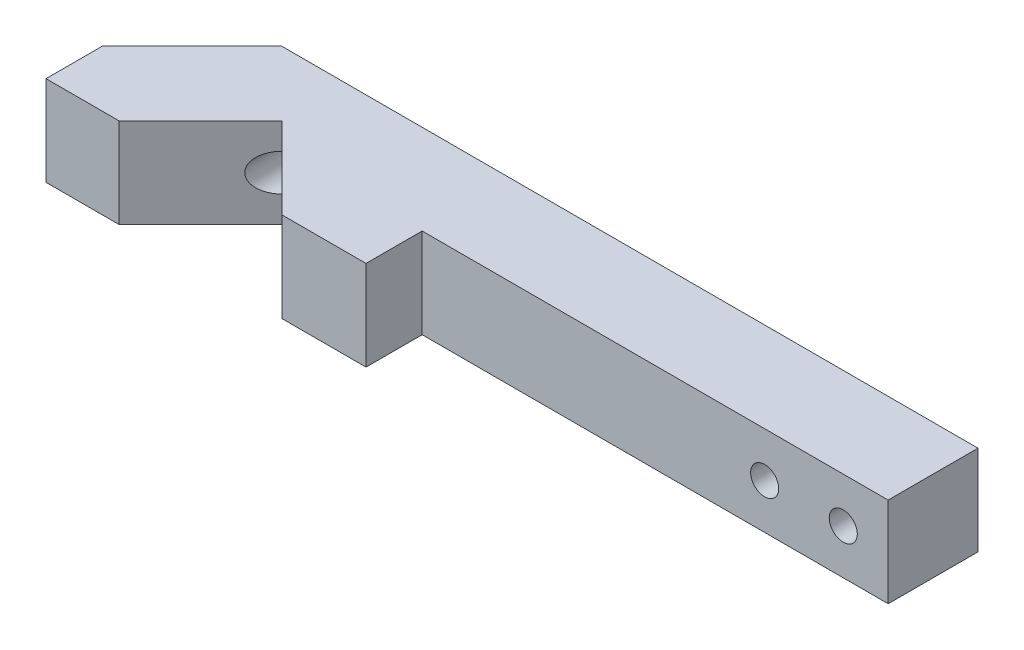
ISO-10303-21;
HEADER;
FILE_DESCRIPTION(('STEP AP214'),'2;1');
FILE_NAME('part.step','',(''),(''),'','','');
FILE_SCHEMA(('AUTOMOTIVE_DESIGN { 1 0 10303 214 1 1 1 1 }'));
ENDSEC;
DATA;
#1=APPLICATION_CONTEXT('core data for automotive mechanical design processes');
#2=APPLICATION_PROTOCOL_DEFINITION('international standard','automotive_design',2000,#1);
#3=PRODUCT_CONTEXT('',#1,'mechanical');
#4=PRODUCT('Part','Part','',(#3));
#5=PRODUCT_RELATED_PRODUCT_CATEGORY('part','',(#4));
#6=PRODUCT_DEFINITION_FORMATION('','',#4);
#7=PRODUCT_DEFINITION_CONTEXT('part definition',#1,'design');
#8=PRODUCT_DEFINITION('design','',#6,#7);
#9=PRODUCT_DEFINITION_SHAPE('','',#8);
#10=(LENGTH_UNIT() NAMED_UNIT(*) SI_UNIT(.MILLI.,.METRE.));
#11=(NAMED_UNIT(*) PLANE_ANGLE_UNIT() SI_UNIT($,.RADIAN.));
#12=(NAMED_UNIT(*) SI_UNIT($,.STERADIAN.) SOLID_ANGLE_UNIT());
#13=UNCERTAINTY_MEASURE_WITH_UNIT(LENGTH_MEASURE(1.E-05),#10,'distance_accuracy_value','');
#14=(GEOMETRIC_REPRESENTATION_CONTEXT(3) GLOBAL_UNCERTAINTY_ASSIGNED_CONTEXT((#13)) GLOBAL_UNIT_ASSIGNED_CONTEXT((#10,
#11,#12)) REPRESENTATION_CONTEXT('',''));
#15=CARTESIAN_POINT('',(0.,0.,0.));
#16=DIRECTION('',(0.,0.,1.));
#17=DIRECTION('',(1.,0.,0.));
#18=AXIS2_PLACEMENT_3D('',#15,#16,#17);
#19=CARTESIAN_POINT('',(-6.50000000000001,8.,4.));
#20=DIRECTION('',(0.,0.,-1.));
#21=DIRECTION('',(-1.,0.,0.));
#22=AXIS2_PLACEMENT_3D('',#19,#20,#21);
#23=PLANE('',#22);
#24=CARTESIAN_POINT('',(31.,4.,4.));
#25=DIRECTION('',(0.,0.,-1.));
#26=DIRECTION('',(-1.,0.,0.));
#27=AXIS2_PLACEMENT_3D('',#24,#25,#26);
#28=CIRCLE('',#27,1.25);
#29=CARTESIAN_POINT('',(29.75,4.,4.));
#30=VERTEX_POINT('',#29);
#31=EDGE_CURVE('E48',#30,#30,#28,.T.);
#32=ORIENTED_EDGE('',*,*,#31,.T.);
#33=EDGE_LOOP('',(#32));
#34=FACE_BOUND('',#33,.T.);
#35=CARTESIAN_POINT('',(24.,4.,4.));
#36=DIRECTION('',(0.,0.,-1.));
#37=DIRECTION('',(-1.,0.,0.));
#38=AXIS2_PLACEMENT_3D('',#35,#36,#37);
#39=CIRCLE('',#38,1.25);
#40=CARTESIAN_POINT('',(22.75,4.,4.));
#41=VERTEX_POINT('',#40);
#42=EDGE_CURVE('E282',#41,#41,#39,.T.);
#43=ORIENTED_EDGE('',*,*,#42,.T.);
#44=EDGE_LOOP('',(#43));
#45=FACE_BOUND('',#44,.T.);
#46=DIRECTION('',(1.,0.,0.));
#47=VECTOR('',#46,1.);
#48=CARTESIAN_POINT('',(-6.50000000000001,0.,4.));
#49=LINE('',#48,#47);
#50=CARTESIAN_POINT('',(-6.50000000000001,0.,4.));
#51=VERTEX_POINT('',#50);
#52=CARTESIAN_POINT('',(35.,0.,4.));
#53=VERTEX_POINT('',#52);
#54=EDGE_CURVE('E168',#51,#53,#49,.T.);
#55=ORIENTED_EDGE('',*,*,#54,.T.);
#56=DIRECTION('',(0.,-1.,0.));
#57=VECTOR('',#56,1.);
#58=CARTESIAN_POINT('',(35.,8.,4.));
#59=LINE('',#58,#57);
#60=CARTESIAN_POINT('',(35.,8.,4.));
#61=VERTEX_POINT('',#60);
#62=EDGE_CURVE('E54',#61,#53,#59,.T.);
#63=ORIENTED_EDGE('',*,*,#62,.F.);
#64=DIRECTION('',(1.,0.,0.));
#65=VECTOR('',#64,1.);
#66=CARTESIAN_POINT('',(-6.50000000000001,8.,4.));
#67=LINE('',#66,#65);
#68=CARTESIAN_POINT('',(-6.50000000000001,8.,4.));
#69=VERTEX_POINT('',#68);
#70=EDGE_CURVE('E198',#69,#61,#67,.T.);
#71=ORIENTED_EDGE('',*,*,#70,.F.);
#72=DIRECTION('',(0.,-1.,0.));
#73=VECTOR('',#72,1.);
#74=CARTESIAN_POINT('',(-6.50000000000001,8.,4.));
#75=LINE('',#74,#73);
#76=EDGE_CURVE('E164',#69,#51,#75,.T.);
#77=ORIENTED_EDGE('',*,*,#76,.T.);
#78=EDGE_LOOP('',(#55,#63,#71,#77));
#79=FACE_BOUND('',#78,.T.);
#80=ADVANCED_FACE('F45',(#34,#45,#79),#23,.F.);
#81=CARTESIAN_POINT('',(35.,8.,-4.));
#82=DIRECTION('',(-1.,0.,0.));
#83=DIRECTION('',(0.,0.,1.));
#84=AXIS2_PLACEMENT_3D('',#81,#82,#83);
#85=PLANE('',#84);
#86=DIRECTION('',(0.,0.,-1.));
#87=VECTOR('',#86,1.);
#88=CARTESIAN_POINT('',(35.,0.,-4.));
#89=LINE('',#88,#87);
#90=CARTESIAN_POINT('',(35.,0.,-4.));
#91=VERTEX_POINT('',#90);
#92=EDGE_CURVE('E172',#53,#91,#89,.T.);
#93=ORIENTED_EDGE('',*,*,#92,.T.);
#94=DIRECTION('',(0.,-1.,0.));
#95=VECTOR('',#94,1.);
#96=CARTESIAN_POINT('',(35.,8.,-4.));
#97=LINE('',#96,#95);
#98=CARTESIAN_POINT('',(35.,8.,-4.));
#99=VERTEX_POINT('',#98);
#100=EDGE_CURVE('E222',#99,#91,#97,.T.);
#101=ORIENTED_EDGE('',*,*,#100,.F.);
#102=DIRECTION('',(0.,0.,-1.));
#103=VECTOR('',#102,1.);
#104=CARTESIAN_POINT('',(35.,8.,-4.));
#105=LINE('',#104,#103);
#106=EDGE_CURVE('E116',#61,#99,#105,.T.);
#107=ORIENTED_EDGE('',*,*,#106,.F.);
#108=ORIENTED_EDGE('',*,*,#62,.T.);
#109=EDGE_LOOP('',(#93,#101,#107,#108));
#110=FACE_BOUND('',#109,.T.);
#111=ADVANCED_FACE('F228',(#110),#85,.F.);
#112=CARTESIAN_POINT('',(-27.0000000000001,8.,-4.));
#113=DIRECTION('',(0.,0.,1.));
#114=DIRECTION('',(1.,0.,0.));
#115=AXIS2_PLACEMENT_3D('',#112,#113,#114);
#116=PLANE('',#115);
#117=CARTESIAN_POINT('',(31.,4.,-4.));
#118=DIRECTION('',(0.,0.,-1.));
#119=DIRECTION('',(-1.,0.,0.));
#120=AXIS2_PLACEMENT_3D('',#117,#118,#119);
#121=CIRCLE('',#120,1.25);
#122=CARTESIAN_POINT('',(29.75,4.,-4.));
#123=VERTEX_POINT('',#122);
#124=EDGE_CURVE('E290',#123,#123,#121,.T.);
#125=ORIENTED_EDGE('',*,*,#124,.F.);
#126=EDGE_LOOP('',(#125));
#127=FACE_BOUND('',#126,.T.);
#128=CARTESIAN_POINT('',(24.,4.,-4.));
#129=DIRECTION('',(0.,0.,-1.));
#130=DIRECTION('',(-1.,0.,0.));
#131=AXIS2_PLACEMENT_3D('',#128,#129,#130);
#132=CIRCLE('',#131,1.25);
#133=CARTESIAN_POINT('',(22.75,4.,-4.));
#134=VERTEX_POINT('',#133);
#135=EDGE_CURVE('E286',#134,#134,#132,.T.);
#136=ORIENTED_EDGE('',*,*,#135,.F.);
#137=EDGE_LOOP('',(#136));
#138=FACE_BOUND('',#137,.T.);
#139=CARTESIAN_POINT('',(-21.25,4.,-4.));
#140=DIRECTION('',(0.,0.,-1.));
#141=DIRECTION('',(-1.,0.,0.));
#142=AXIS2_PLACEMENT_3D('',#139,#140,#141);
#143=CIRCLE('',#142,1.65);
#144=CARTESIAN_POINT('',(-22.9,4.,-4.));
#145=VERTEX_POINT('',#144);
#146=EDGE_CURVE('E271',#145,#145,#143,.T.);
#147=ORIENTED_EDGE('',*,*,#146,.F.);
#148=EDGE_LOOP('',(#147));
#149=FACE_BOUND('',#148,.T.);
#150=DIRECTION('',(-1.,0.,0.));
#151=VECTOR('',#150,1.);
#152=CARTESIAN_POINT('',(-27.0000000000001,0.,-4.));
#153=LINE('',#152,#151);
#154=CARTESIAN_POINT('',(-27.0000000000001,0.,-4.));
#155=VERTEX_POINT('',#154);
#156=EDGE_CURVE('E175',#91,#155,#153,.T.);
#157=ORIENTED_EDGE('',*,*,#156,.T.);
#158=DIRECTION('',(0.,-1.,0.));
#159=VECTOR('',#158,1.);
#160=CARTESIAN_POINT('',(-27.0000000000001,8.,-4.));
#161=LINE('',#160,#159);
#162=CARTESIAN_POINT('',(-27.0000000000001,8.,-4.));
#163=VERTEX_POINT('',#162);
#164=EDGE_CURVE('E218',#163,#155,#161,.T.);
#165=ORIENTED_EDGE('',*,*,#164,.F.);
#166=DIRECTION('',(-1.,0.,0.));
#167=VECTOR('',#166,1.);
#168=CARTESIAN_POINT('',(-27.0000000000001,8.,-4.));
#169=LINE('',#168,#167);
#170=EDGE_CURVE('E249',#99,#163,#169,.T.);
#171=ORIENTED_EDGE('',*,*,#170,.F.);
#172=ORIENTED_EDGE('',*,*,#100,.T.);
#173=EDGE_LOOP('',(#157,#165,#171,#172));
#174=FACE_BOUND('',#173,.T.);
#175=ADVANCED_FACE('F239',(#127,#138,#149,#174),#116,.F.);
#176=CARTESIAN_POINT('',(-35.,8.,4.));
#177=DIRECTION('',(0.707106781186553,0.,0.707106781186542));
#178=DIRECTION('',(0.707106781186542,0.,-0.707106781186553));
#179=AXIS2_PLACEMENT_3D('',#176,#177,#178);
#180=PLANE('',#179);
#181=DIRECTION('',(-0.707106781186542,0.,0.707106781186553));
#182=VECTOR('',#181,1.);
#183=CARTESIAN_POINT('',(-35.,0.,4.));
#184=LINE('',#183,#182);
#185=CARTESIAN_POINT('',(-35.,0.,4.));
#186=VERTEX_POINT('',#185);
#187=EDGE_CURVE('E178',#155,#186,#184,.T.);
#188=ORIENTED_EDGE('',*,*,#187,.T.);
#189=DIRECTION('',(0.,-1.,0.));
#190=VECTOR('',#189,1.);
#191=CARTESIAN_POINT('',(-35.,8.,4.));
#192=LINE('',#191,#190);
#193=CARTESIAN_POINT('',(-35.,8.,4.));
#194=VERTEX_POINT('',#193);
#195=EDGE_CURVE('E214',#194,#186,#192,.T.);
#196=ORIENTED_EDGE('',*,*,#195,.F.);
#197=DIRECTION('',(-0.707106781186542,0.,0.707106781186553));
#198=VECTOR('',#197,1.);
#199=CARTESIAN_POINT('',(-35.,8.,4.));
#200=LINE('',#199,#198);
#201=EDGE_CURVE('E245',#163,#194,#200,.T.);
#202=ORIENTED_EDGE('',*,*,#201,.F.);
#203=ORIENTED_EDGE('',*,*,#164,.T.);
#204=EDGE_LOOP('',(#188,#196,#202,#203));
#205=FACE_BOUND('',#204,.T.);
#206=ADVANCED_FACE('F243',(#205),#180,.F.);
#207=CARTESIAN_POINT('',(-35.,8.,4.));
#208=DIRECTION('',(1.,0.,0.));
#209=DIRECTION('',(0.,0.,-1.));
#210=AXIS2_PLACEMENT_3D('',#207,#208,#209);
#211=PLANE('',#210);
#212=DIRECTION('',(0.,0.,1.));
#213=VECTOR('',#212,1.);
#214=CARTESIAN_POINT('',(-35.,0.,4.));
#215=LINE('',#214,#213);
#216=CARTESIAN_POINT('',(-35.,0.,9.));
#217=VERTEX_POINT('',#216);
#218=EDGE_CURVE('E181',#186,#217,#215,.T.);
#219=ORIENTED_EDGE('',*,*,#218,.T.);
#220=DIRECTION('',(0.,-1.,0.));
#221=VECTOR('',#220,1.);
#222=CARTESIAN_POINT('',(-35.,8.,9.));
#223=LINE('',#222,#221);
#224=CARTESIAN_POINT('',(-35.,8.,9.));
#225=VERTEX_POINT('',#224);
#226=EDGE_CURVE('E210',#225,#217,#223,.T.);
#227=ORIENTED_EDGE('',*,*,#226,.F.);
#228=DIRECTION('',(0.,0.,1.));
#229=VECTOR('',#228,1.);
#230=CARTESIAN_POINT('',(-35.,8.,4.));
#231=LINE('',#230,#229);
#232=EDGE_CURVE('E248',#194,#225,#231,.T.);
#233=ORIENTED_EDGE('',*,*,#232,.F.);
#234=ORIENTED_EDGE('',*,*,#195,.T.);
#235=EDGE_LOOP('',(#219,#227,#233,#234));
#236=FACE_BOUND('',#235,.T.);
#237=ADVANCED_FACE('F323',(#236),#211,.F.);
#238=CARTESIAN_POINT('',(-35.,8.,9.));
#239=DIRECTION('',(0.,0.,-1.));
#240=DIRECTION('',(-1.,0.,0.));
#241=AXIS2_PLACEMENT_3D('',#238,#239,#240);
#242=PLANE('',#241);
#243=DIRECTION('',(1.,0.,0.));
#244=VECTOR('',#243,1.);
#245=CARTESIAN_POINT('',(-35.,0.,9.));
#246=LINE('',#245,#244);
#247=CARTESIAN_POINT('',(-28.5,0.,9.));
#248=VERTEX_POINT('',#247);
#249=EDGE_CURVE('E184',#217,#248,#246,.T.);
#250=ORIENTED_EDGE('',*,*,#249,.T.);
#251=DIRECTION('',(0.,-1.,0.));
#252=VECTOR('',#251,1.);
#253=CARTESIAN_POINT('',(-28.5,8.,9.));
#254=LINE('',#253,#252);
#255=CARTESIAN_POINT('',(-28.5,8.,9.));
#256=VERTEX_POINT('',#255);
#257=EDGE_CURVE('E206',#256,#248,#254,.T.);
#258=ORIENTED_EDGE('',*,*,#257,.F.);
#259=DIRECTION('',(1.,0.,0.));
#260=VECTOR('',#259,1.);
#261=CARTESIAN_POINT('',(-35.,8.,9.));
#262=LINE('',#261,#260);
#263=EDGE_CURVE('E253',#225,#256,#262,.T.);
#264=ORIENTED_EDGE('',*,*,#263,.F.);
#265=ORIENTED_EDGE('',*,*,#226,.T.);
#266=EDGE_LOOP('',(#250,#258,#264,#265));
#267=FACE_BOUND('',#266,.T.);
#268=ADVANCED_FACE('F264',(#267),#242,.F.);
#269=CARTESIAN_POINT('',(-28.5,8.,9.));
#270=DIRECTION('',(-0.707106781186551,0.,-0.707106781186544));
#271=DIRECTION('',(-0.707106781186544,0.,0.707106781186551));
#272=AXIS2_PLACEMENT_3D('',#269,#270,#271);
#273=PLANE('',#272);
#274=DIRECTION('',(0.,-1.,0.));
#275=VECTOR('',#274,1.);
#276=CARTESIAN_POINT('',(-21.25,8.,1.74999999999993));
#277=LINE('',#276,#275);
#278=CARTESIAN_POINT('',(-21.25,2.35,1.74999999999993));
#279=VERTEX_POINT('',#278);
#280=CARTESIAN_POINT('',(-21.25,0.,1.74999999999993));
#281=VERTEX_POINT('',#280);
#282=EDGE_CURVE('E157',#279,#281,#277,.T.);
#283=ORIENTED_EDGE('',*,*,#282,.F.);
#284=CARTESIAN_POINT('',(-21.25,4.,1.74999999999992));
#285=DIRECTION('',(-0.707106781186551,0.,-0.707106781186544));
#286=DIRECTION('',(0.707106781186544,0.,-0.707106781186551));
#287=AXIS2_PLACEMENT_3D('',#284,#285,#286);
#288=ELLIPSE('',#287,2.33345237791561,1.65);
#289=CARTESIAN_POINT('',(-21.25,5.65,1.74999999999993));
#290=VERTEX_POINT('',#289);
#291=EDGE_CURVE('E11',#279,#290,#288,.T.);
#292=ORIENTED_EDGE('',*,*,#291,.T.);
#293=CARTESIAN_POINT('',(-21.25,8.,1.74999999999993));
#294=VERTEX_POINT('',#293);
#295=EDGE_CURVE('E203',#294,#290,#277,.T.);
#296=ORIENTED_EDGE('',*,*,#295,.F.);
#297=DIRECTION('',(0.707106781186544,0.,-0.707106781186551));
#298=VECTOR('',#297,1.);
#299=CARTESIAN_POINT('',(-28.5,8.,9.));
#300=LINE('',#299,#298);
#301=EDGE_CURVE('E143',#256,#294,#300,.T.);
#302=ORIENTED_EDGE('',*,*,#301,.F.);
#303=ORIENTED_EDGE('',*,*,#257,.T.);
#304=DIRECTION('',(0.707106781186544,0.,-0.707106781186551));
#305=VECTOR('',#304,1.);
#306=CARTESIAN_POINT('',(-28.5,0.,9.));
#307=LINE('',#306,#305);
#308=EDGE_CURVE('E187',#248,#281,#307,.T.);
#309=ORIENTED_EDGE('',*,*,#308,.T.);
#310=EDGE_LOOP('',(#283,#292,#296,#302,#303,#309));
#311=FACE_BOUND('',#310,.T.);
#312=ADVANCED_FACE('F269',(#311),#273,.F.);
#313=CARTESIAN_POINT('',(-21.25,8.,1.74999999999993));
#314=DIRECTION('',(0.707106781186548,0.,-0.707106781186547));
#315=DIRECTION('',(-0.707106781186547,0.,-0.707106781186548));
#316=AXIS2_PLACEMENT_3D('',#313,#314,#315);
#317=PLANE('',#316);
#318=ORIENTED_EDGE('',*,*,#295,.T.);
#319=CARTESIAN_POINT('',(-21.25,4.,1.74999999999995));
#320=DIRECTION('',(0.707106781186548,0.,-0.707106781186547));
#321=DIRECTION('',(-0.707106781186547,0.,-0.707106781186548));
#322=AXIS2_PLACEMENT_3D('',#319,#320,#321);
#323=ELLIPSE('',#322,2.3334523779156,1.65);
#324=EDGE_CURVE('E60',#290,#279,#323,.T.);
#325=ORIENTED_EDGE('',*,*,#324,.T.);
#326=ORIENTED_EDGE('',*,*,#282,.T.);
#327=DIRECTION('',(0.707106781186547,0.,0.707106781186548));
#328=VECTOR('',#327,1.);
#329=CARTESIAN_POINT('',(-21.25,0.,1.74999999999993));
#330=LINE('',#329,#328);
#331=CARTESIAN_POINT('',(-14.,0.,9.));
#332=VERTEX_POINT('',#331);
#333=EDGE_CURVE('E153',#281,#332,#330,.T.);
#334=ORIENTED_EDGE('',*,*,#333,.T.);
#335=DIRECTION('',(0.,-1.,0.));
#336=VECTOR('',#335,1.);
#337=CARTESIAN_POINT('',(-14.,8.,9.));
#338=LINE('',#337,#336);
#339=CARTESIAN_POINT('',(-14.,8.,9.));
#340=VERTEX_POINT('',#339);
#341=EDGE_CURVE('E150',#340,#332,#338,.T.);
#342=ORIENTED_EDGE('',*,*,#341,.F.);
#343=DIRECTION('',(0.707106781186547,0.,0.707106781186548));
#344=VECTOR('',#343,1.);
#345=CARTESIAN_POINT('',(-21.25,8.,1.74999999999993));
#346=LINE('',#345,#344);
#347=EDGE_CURVE('E136',#294,#340,#346,.T.);
#348=ORIENTED_EDGE('',*,*,#347,.F.);
#349=EDGE_LOOP('',(#318,#325,#326,#334,#342,#348));
#350=FACE_BOUND('',#349,.T.);
#351=ADVANCED_FACE('F151',(#350),#317,.F.);
#352=CARTESIAN_POINT('',(-14.,8.,9.));
#353=DIRECTION('',(0.,0.,-1.));
#354=DIRECTION('',(-1.,0.,0.));
#355=AXIS2_PLACEMENT_3D('',#352,#353,#354);
#356=PLANE('',#355);
#357=DIRECTION('',(1.,0.,0.));
#358=VECTOR('',#357,1.);
#359=CARTESIAN_POINT('',(-14.,0.,9.));
#360=LINE('',#359,#358);
#361=CARTESIAN_POINT('',(-6.5,0.,9.));
#362=VERTEX_POINT('',#361);
#363=EDGE_CURVE('E193',#332,#362,#360,.T.);
#364=ORIENTED_EDGE('',*,*,#363,.T.);
#365=DIRECTION('',(0.,-1.,0.));
#366=VECTOR('',#365,1.);
#367=CARTESIAN_POINT('',(-6.5,8.,9.));
#368=LINE('',#367,#366);
#369=CARTESIAN_POINT('',(-6.5,8.,9.));
#370=VERTEX_POINT('',#369);
#371=EDGE_CURVE('E158',#370,#362,#368,.T.);
#372=ORIENTED_EDGE('',*,*,#371,.F.);
#373=DIRECTION('',(1.,0.,0.));
#374=VECTOR('',#373,1.);
#375=CARTESIAN_POINT('',(-14.,8.,9.));
#376=LINE('',#375,#374);
#377=EDGE_CURVE('E140',#340,#370,#376,.T.);
#378=ORIENTED_EDGE('',*,*,#377,.F.);
#379=ORIENTED_EDGE('',*,*,#341,.T.);
#380=EDGE_LOOP('',(#364,#372,#378,#379));
#381=FACE_BOUND('',#380,.T.);
#382=ADVANCED_FACE('F160',(#381),#356,.F.);
#383=CARTESIAN_POINT('',(-6.50000000000001,8.,4.));
#384=DIRECTION('',(-1.,0.,0.));
#385=DIRECTION('',(0.,0.,1.));
#386=AXIS2_PLACEMENT_3D('',#383,#384,#385);
#387=PLANE('',#386);
#388=DIRECTION('',(0.,0.,-1.));
#389=VECTOR('',#388,1.);
#390=CARTESIAN_POINT('',(-6.50000000000001,0.,4.));
#391=LINE('',#390,#389);
#392=EDGE_CURVE('E107',#362,#51,#391,.T.);
#393=ORIENTED_EDGE('',*,*,#392,.T.);
#394=ORIENTED_EDGE('',*,*,#76,.F.);
#395=DIRECTION('',(0.,0.,-1.));
#396=VECTOR('',#395,1.);
#397=CARTESIAN_POINT('',(-6.50000000000001,8.,4.));
#398=LINE('',#397,#396);
#399=EDGE_CURVE('E68',#370,#69,#398,.T.);
#400=ORIENTED_EDGE('',*,*,#399,.F.);
#401=ORIENTED_EDGE('',*,*,#371,.T.);
#402=EDGE_LOOP('',(#393,#394,#400,#401));
#403=FACE_BOUND('',#402,.T.);
#404=ADVANCED_FACE('F274',(#403),#387,.F.);
#405=CARTESIAN_POINT('',(0.,8.,0.));
#406=DIRECTION('',(0.,-1.,0.));
#407=DIRECTION('',(0.,0.,-1.));
#408=AXIS2_PLACEMENT_3D('',#405,#406,#407);
#409=PLANE('',#408);
#410=ORIENTED_EDGE('',*,*,#70,.T.);
#411=ORIENTED_EDGE('',*,*,#106,.T.);
#412=ORIENTED_EDGE('',*,*,#170,.T.);
#413=ORIENTED_EDGE('',*,*,#201,.T.);
#414=ORIENTED_EDGE('',*,*,#232,.T.);
#415=ORIENTED_EDGE('',*,*,#263,.T.);
#416=ORIENTED_EDGE('',*,*,#301,.T.);
#417=ORIENTED_EDGE('',*,*,#347,.T.);
#418=ORIENTED_EDGE('',*,*,#377,.T.);
#419=ORIENTED_EDGE('',*,*,#399,.T.);
#420=EDGE_LOOP('',(#410,#411,#412,#413,#414,#415,#416,#417,#418,#419));
#421=FACE_BOUND('',#420,.T.);
#422=ADVANCED_FACE('F138',(#421),#409,.F.);
#423=CARTESIAN_POINT('',(0.,0.,0.));
#424=DIRECTION('',(0.,-1.,0.));
#425=DIRECTION('',(0.,0.,-1.));
#426=AXIS2_PLACEMENT_3D('',#423,#424,#425);
#427=PLANE('',#426);
#428=ORIENTED_EDGE('',*,*,#54,.F.);
#429=ORIENTED_EDGE('',*,*,#392,.F.);
#430=ORIENTED_EDGE('',*,*,#363,.F.);
#431=ORIENTED_EDGE('',*,*,#333,.F.);
#432=ORIENTED_EDGE('',*,*,#308,.F.);
#433=ORIENTED_EDGE('',*,*,#249,.F.);
#434=ORIENTED_EDGE('',*,*,#218,.F.);
#435=ORIENTED_EDGE('',*,*,#187,.F.);
#436=ORIENTED_EDGE('',*,*,#156,.F.);
#437=ORIENTED_EDGE('',*,*,#92,.F.);
#438=EDGE_LOOP('',(#428,#429,#430,#431,#432,#433,#434,#435,#436,#437));
#439=FACE_BOUND('',#438,.T.);
#440=ADVANCED_FACE('F233',(#439),#427,.T.);
#441=CARTESIAN_POINT('',(-21.25,4.,-4.));
#442=DIRECTION('',(0.,0.,-1.));
#443=DIRECTION('',(-1.,0.,0.));
#444=AXIS2_PLACEMENT_3D('',#441,#442,#443);
#445=CYLINDRICAL_SURFACE('',#444,1.65);
#446=ORIENTED_EDGE('',*,*,#146,.T.);
#447=EDGE_LOOP('',(#446));
#448=FACE_BOUND('',#447,.T.);
#449=ORIENTED_EDGE('',*,*,#291,.F.);
#450=ORIENTED_EDGE('',*,*,#324,.F.);
#451=EDGE_LOOP('',(#449,#450));
#452=FACE_BOUND('',#451,.T.);
#453=ADVANCED_FACE('F308',(#448,#452),#445,.F.);
#454=CARTESIAN_POINT('',(24.,4.,-4.));
#455=DIRECTION('',(0.,0.,-1.));
#456=DIRECTION('',(-1.,0.,0.));
#457=AXIS2_PLACEMENT_3D('',#454,#455,#456);
#458=CYLINDRICAL_SURFACE('',#457,1.25);
#459=ORIENTED_EDGE('',*,*,#135,.T.);
#460=EDGE_LOOP('',(#459));
#461=FACE_BOUND('',#460,.T.);
#462=ORIENTED_EDGE('',*,*,#42,.F.);
#463=EDGE_LOOP('',(#462));
#464=FACE_BOUND('',#463,.T.);
#465=ADVANCED_FACE('F303',(#461,#464),#458,.F.);
#466=CARTESIAN_POINT('',(31.,4.,-4.));
#467=DIRECTION('',(0.,0.,-1.));
#468=DIRECTION('',(-1.,0.,0.));
#469=AXIS2_PLACEMENT_3D('',#466,#467,#468);
#470=CYLINDRICAL_SURFACE('',#469,1.25);
#471=ORIENTED_EDGE('',*,*,#124,.T.);
#472=EDGE_LOOP('',(#471));
#473=FACE_BOUND('',#472,.T.);
#474=ORIENTED_EDGE('',*,*,#31,.F.);
#475=EDGE_LOOP('',(#474));
#476=FACE_BOUND('',#475,.T.);
#477=ADVANCED_FACE('F301',(#473,#476),#470,.F.);
#478=CLOSED_SHELL('',(#80,#111,#175,#206,#237,#268,#312,#351,#382,#404,#422,#440,#453,#465,#477));
#479=MANIFOLD_SOLID_BREP('B2',#478);
#480=ADVANCED_BREP_SHAPE_REPRESENTATION('',(#18,#479),#14);
#481=SHAPE_DEFINITION_REPRESENTATION(#9,#480);
ENDSEC;
END-ISO-10303-21;
